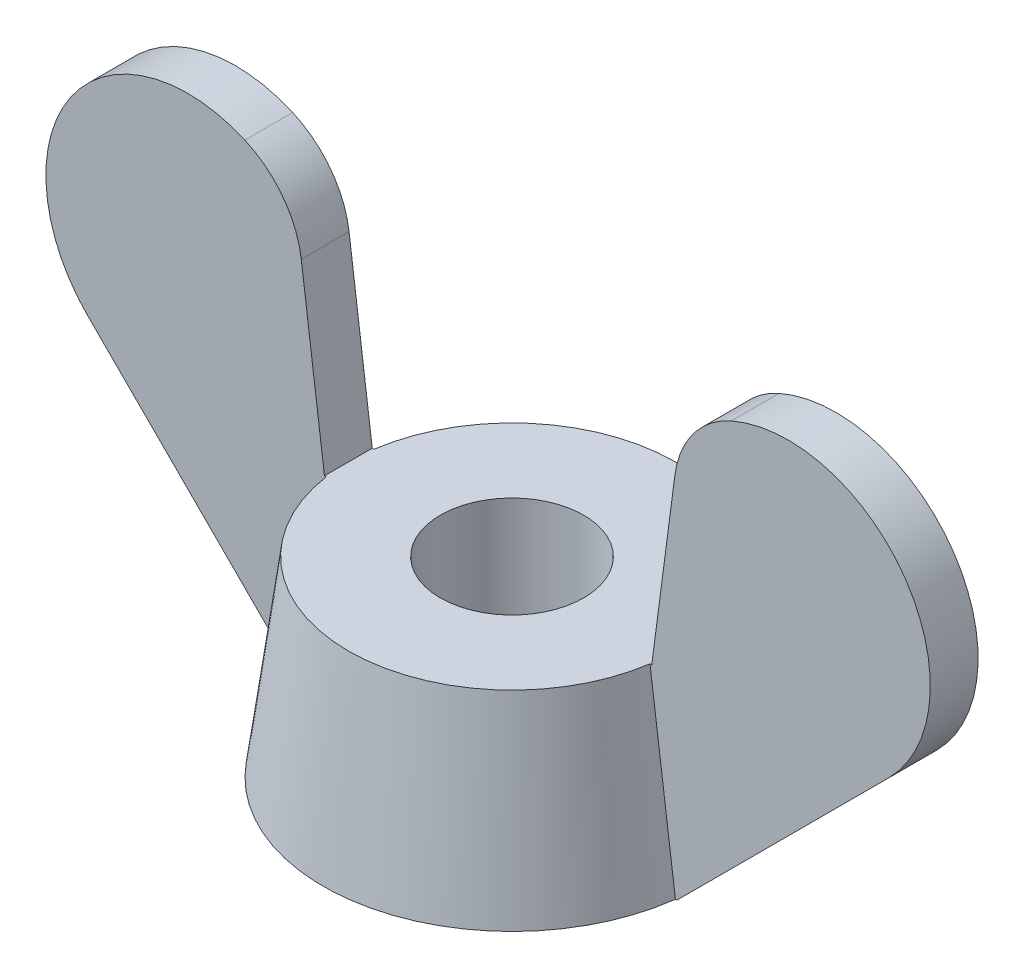
ISO-10303-21;
HEADER;
FILE_DESCRIPTION(('STEP AP214'),'2;1');
FILE_NAME('part.step','',(''),(''),'','','');
FILE_SCHEMA(('AUTOMOTIVE_DESIGN { 1 0 10303 214 1 1 1 1 }'));
ENDSEC;
DATA;
#1=APPLICATION_CONTEXT('core data for automotive mechanical design processes');
#2=APPLICATION_PROTOCOL_DEFINITION('international standard','automotive_design',2000,#1);
#3=PRODUCT_CONTEXT('',#1,'mechanical');
#4=PRODUCT('Part','Part','',(#3));
#5=PRODUCT_RELATED_PRODUCT_CATEGORY('part','',(#4));
#6=PRODUCT_DEFINITION_FORMATION('','',#4);
#7=PRODUCT_DEFINITION_CONTEXT('part definition',#1,'design');
#8=PRODUCT_DEFINITION('design','',#6,#7);
#9=PRODUCT_DEFINITION_SHAPE('','',#8);
#10=(LENGTH_UNIT() NAMED_UNIT(*) SI_UNIT(.MILLI.,.METRE.));
#11=(NAMED_UNIT(*) PLANE_ANGLE_UNIT() SI_UNIT($,.RADIAN.));
#12=(NAMED_UNIT(*) SI_UNIT($,.STERADIAN.) SOLID_ANGLE_UNIT());
#13=UNCERTAINTY_MEASURE_WITH_UNIT(LENGTH_MEASURE(1.E-05),#10,'distance_accuracy_value','');
#14=(GEOMETRIC_REPRESENTATION_CONTEXT(3) GLOBAL_UNCERTAINTY_ASSIGNED_CONTEXT((#13)) GLOBAL_UNIT_ASSIGNED_CONTEXT((#10,
#11,#12)) REPRESENTATION_CONTEXT('',''));
#15=CARTESIAN_POINT('',(0.,0.,0.));
#16=DIRECTION('',(0.,0.,1.));
#17=DIRECTION('',(1.,0.,0.));
#18=AXIS2_PLACEMENT_3D('',#15,#16,#17);
#19=CARTESIAN_POINT('',(0.,0.,0.));
#20=DIRECTION('',(0.,-1.,0.));
#21=DIRECTION('',(0.,0.,1.));
#22=AXIS2_PLACEMENT_3D('',#19,#20,#21);
#23=CONICAL_SURFACE('',#22,3.95,0.130899693899575);
#24=CARTESIAN_POINT('',(-2.79014935307168,8.47233595499958,-0.5));
#25=CARTESIAN_POINT('',(-2.90094093792132,7.64393694550985,-0.5));
#26=CARTESIAN_POINT('',(-3.01154454406097,6.81551283083668,-0.5));
#27=CARTESIAN_POINT('',(-3.23246038122402,5.1586258135231,-0.5));
#28=CARTESIAN_POINT('',(-3.34277261227046,4.33016291088576,-0.5));
#29=CARTESIAN_POINT('',(-3.62976592758949,2.17273839388854,-0.5));
#30=CARTESIAN_POINT('',(-3.80628437354511,0.843755152208538,-0.5));
#31=CARTESIAN_POINT('',(-4.15895766998451,-1.81425975195012,-0.5));
#32=CARTESIAN_POINT('',(-4.33511252042257,-3.14329141443485,-0.5));
#33=CARTESIAN_POINT('',(-4.51116977917809,-4.47233595499958,-0.5));
#34=B_SPLINE_CURVE_WITH_KNOTS('',3,(#24,#25,#26,#27,#28,#29,#30,#31,#32,#33),.UNSPECIFIED.,.F.,
.F.,(4,2,2,2,4),(0.,2.50732464755372,5.01464909685827,9.03661335227564,13.0585781134314),.UNSPECIFIED.);
#35=CARTESIAN_POINT('',(-3.38667966571601,4.,-0.5));
#36=VERTEX_POINT('',#35);
#37=CARTESIAN_POINT('',(-3.91822663969301,0.,-0.5));
#38=VERTEX_POINT('',#37);
#39=EDGE_CURVE('E57',#36,#38,#34,.T.);
#40=ORIENTED_EDGE('',*,*,#39,.F.);
#41=CARTESIAN_POINT('',(0.,4.,0.));
#42=DIRECTION('',(0.,1.,0.));
#43=DIRECTION('',(0.,0.,1.));
#44=AXIS2_PLACEMENT_3D('',#41,#42,#43);
#45=CIRCLE('',#44,3.42339000965042);
#46=CARTESIAN_POINT('',(3.38667966571601,4.,-0.5));
#47=VERTEX_POINT('',#46);
#48=EDGE_CURVE('E11',#47,#36,#45,.T.);
#49=ORIENTED_EDGE('',*,*,#48,.F.);
#50=CARTESIAN_POINT('',(2.79014935307168,8.47233595499958,-0.5));
#51=CARTESIAN_POINT('',(2.90094093792132,7.64393694550985,-0.5));
#52=CARTESIAN_POINT('',(3.01154454406097,6.81551283083668,-0.5));
#53=CARTESIAN_POINT('',(3.23246038122402,5.1586258135231,-0.5));
#54=CARTESIAN_POINT('',(3.34277261227046,4.33016291088576,-0.5));
#55=CARTESIAN_POINT('',(3.62976592758949,2.17273839388854,-0.5));
#56=CARTESIAN_POINT('',(3.80628437354511,0.843755152208538,-0.5));
#57=CARTESIAN_POINT('',(4.15895766998451,-1.81425975195012,-0.5));
#58=CARTESIAN_POINT('',(4.33511252042257,-3.14329141443485,-0.5));
#59=CARTESIAN_POINT('',(4.51116977917809,-4.47233595499958,-0.5));
#60=B_SPLINE_CURVE_WITH_KNOTS('',3,(#50,#51,#52,#53,#54,#55,#56,#57,#58,#59),.UNSPECIFIED.,.F.,
.F.,(4,2,2,2,4),(0.,2.50732464755372,5.01464909685827,9.03661335227564,13.0585781134314),.UNSPECIFIED.);
#61=CARTESIAN_POINT('',(3.91822663969301,0.,-0.5));
#62=VERTEX_POINT('',#61);
#63=EDGE_CURVE('E215',#47,#62,#60,.T.);
#64=ORIENTED_EDGE('',*,*,#63,.T.);
#65=CARTESIAN_POINT('',(0.,0.,0.));
#66=DIRECTION('',(0.,1.,0.));
#67=DIRECTION('',(0.,0.,1.));
#68=AXIS2_PLACEMENT_3D('',#65,#66,#67);
#69=CIRCLE('',#68,3.95);
#70=EDGE_CURVE('E226',#62,#38,#69,.T.);
#71=ORIENTED_EDGE('',*,*,#70,.T.);
#72=EDGE_LOOP('',(#40,#49,#64,#71));
#73=FACE_BOUND('',#72,.T.);
#74=ADVANCED_FACE('F34',(#73),#23,.T.);
#75=CARTESIAN_POINT('',(-3.38667966571601,4.,0.5));
#76=VERTEX_POINT('',#75);
#77=CARTESIAN_POINT('',(3.38667966571601,4.,0.5));
#78=VERTEX_POINT('',#77);
#79=EDGE_CURVE('E43',#76,#78,#45,.T.);
#80=ORIENTED_EDGE('',*,*,#79,.F.);
#81=CARTESIAN_POINT('',(-2.79014935307168,8.47233595499958,0.5));
#82=CARTESIAN_POINT('',(-2.90094093792132,7.64393694550985,0.5));
#83=CARTESIAN_POINT('',(-3.01154454406097,6.81551283083668,0.5));
#84=CARTESIAN_POINT('',(-3.23246038122402,5.1586258135231,0.5));
#85=CARTESIAN_POINT('',(-3.34277261227046,4.33016291088576,0.5));
#86=CARTESIAN_POINT('',(-3.62976592758949,2.17273839388854,0.5));
#87=CARTESIAN_POINT('',(-3.80628437354511,0.843755152208538,0.5));
#88=CARTESIAN_POINT('',(-4.15895766998451,-1.81425975195012,0.5));
#89=CARTESIAN_POINT('',(-4.33511252042257,-3.14329141443485,0.5));
#90=CARTESIAN_POINT('',(-4.51116977917809,-4.47233595499958,0.5));
#91=B_SPLINE_CURVE_WITH_KNOTS('',3,(#81,#82,#83,#84,#85,#86,#87,#88,#89,#90),.UNSPECIFIED.,.F.,
.F.,(4,2,2,2,4),(0.,2.50732464755372,5.01464909685827,9.03661335227564,13.0585781134314),.UNSPECIFIED.);
#92=CARTESIAN_POINT('',(-3.91822663969301,0.,0.5));
#93=VERTEX_POINT('',#92);
#94=EDGE_CURVE('E140',#76,#93,#91,.T.);
#95=ORIENTED_EDGE('',*,*,#94,.T.);
#96=CARTESIAN_POINT('',(3.91822663969301,0.,0.5));
#97=VERTEX_POINT('',#96);
#98=EDGE_CURVE('E224',#93,#97,#69,.T.);
#99=ORIENTED_EDGE('',*,*,#98,.T.);
#100=CARTESIAN_POINT('',(2.79014935307168,8.47233595499958,0.5));
#101=CARTESIAN_POINT('',(2.90094093792132,7.64393694550985,0.5));
#102=CARTESIAN_POINT('',(3.01154454406097,6.81551283083668,0.5));
#103=CARTESIAN_POINT('',(3.23246038122402,5.1586258135231,0.5));
#104=CARTESIAN_POINT('',(3.34277261227046,4.33016291088576,0.5));
#105=CARTESIAN_POINT('',(3.62976592758949,2.17273839388854,0.5));
#106=CARTESIAN_POINT('',(3.80628437354511,0.843755152208538,0.5));
#107=CARTESIAN_POINT('',(4.15895766998451,-1.81425975195012,0.5));
#108=CARTESIAN_POINT('',(4.33511252042257,-3.14329141443485,0.5));
#109=CARTESIAN_POINT('',(4.51116977917809,-4.47233595499958,0.5));
#110=B_SPLINE_CURVE_WITH_KNOTS('',3,(#100,#101,#102,#103,#104,#105,#106,#107,#108,#109),
.UNSPECIFIED.,.F.,.F.,(4,2,2,2,4),(0.,2.50732464755372,5.01464909685827,9.03661335227564,
13.0585781134314),.UNSPECIFIED.);
#111=EDGE_CURVE('E206',#78,#97,#110,.T.);
#112=ORIENTED_EDGE('',*,*,#111,.F.);
#113=EDGE_LOOP('',(#80,#95,#99,#112));
#114=FACE_BOUND('',#113,.T.);
#115=ADVANCED_FACE('F36',(#114),#23,.T.);
#116=CARTESIAN_POINT('',(0.,4.,0.));
#117=DIRECTION('',(0.,1.,0.));
#118=DIRECTION('',(0.,0.,1.));
#119=AXIS2_PLACEMENT_3D('',#116,#117,#118);
#120=PLANE('',#119);
#121=DIRECTION('',(-1.,0.,0.));
#122=VECTOR('',#121,1.);
#123=CARTESIAN_POINT('',(-3.42339000965042,4.,-0.5));
#124=LINE('',#123,#122);
#125=CARTESIAN_POINT('',(-3.42339000965042,4.,-0.5));
#126=VERTEX_POINT('',#125);
#127=EDGE_CURVE('E157',#36,#126,#124,.T.);
#128=ORIENTED_EDGE('',*,*,#127,.T.);
#129=DIRECTION('',(0.,0.,-1.));
#130=VECTOR('',#129,1.);
#131=CARTESIAN_POINT('',(-3.42339000965042,4.,0.5));
#132=LINE('',#131,#130);
#133=CARTESIAN_POINT('',(-3.42339000965042,4.,0.5));
#134=VERTEX_POINT('',#133);
#135=EDGE_CURVE('E147',#134,#126,#132,.T.);
#136=ORIENTED_EDGE('',*,*,#135,.F.);
#137=DIRECTION('',(-1.,0.,0.));
#138=VECTOR('',#137,1.);
#139=CARTESIAN_POINT('',(-3.42339000965042,4.,0.5));
#140=LINE('',#139,#138);
#141=EDGE_CURVE('E134',#76,#134,#140,.T.);
#142=ORIENTED_EDGE('',*,*,#141,.F.);
#143=ORIENTED_EDGE('',*,*,#79,.T.);
#144=DIRECTION('',(-1.,0.,0.));
#145=VECTOR('',#144,1.);
#146=CARTESIAN_POINT('',(3.42339000965042,4.,0.5));
#147=LINE('',#146,#145);
#148=CARTESIAN_POINT('',(3.42339000965042,4.,0.5));
#149=VERTEX_POINT('',#148);
#150=EDGE_CURVE('E238',#149,#78,#147,.T.);
#151=ORIENTED_EDGE('',*,*,#150,.F.);
#152=DIRECTION('',(0.,0.,-1.));
#153=VECTOR('',#152,1.);
#154=CARTESIAN_POINT('',(3.42339000965042,4.,0.5));
#155=LINE('',#154,#153);
#156=CARTESIAN_POINT('',(3.42339000965042,4.,-0.5));
#157=VERTEX_POINT('',#156);
#158=EDGE_CURVE('E258',#149,#157,#155,.T.);
#159=ORIENTED_EDGE('',*,*,#158,.T.);
#160=DIRECTION('',(-1.,0.,0.));
#161=VECTOR('',#160,1.);
#162=CARTESIAN_POINT('',(3.42339000965042,4.,-0.5));
#163=LINE('',#162,#161);
#164=EDGE_CURVE('E245',#157,#47,#163,.T.);
#165=ORIENTED_EDGE('',*,*,#164,.T.);
#166=ORIENTED_EDGE('',*,*,#48,.T.);
#167=EDGE_LOOP('',(#128,#136,#142,#143,#151,#159,#165,#166));
#168=FACE_BOUND('',#167,.T.);
#169=CARTESIAN_POINT('',(0.,4.,0.));
#170=DIRECTION('',(0.,1.,0.));
#171=DIRECTION('',(0.,0.,1.));
#172=AXIS2_PLACEMENT_3D('',#169,#170,#171);
#173=CIRCLE('',#172,1.5);
#174=CARTESIAN_POINT('',(0.,4.,1.5));
#175=VERTEX_POINT('',#174);
#176=EDGE_CURVE('E221',#175,#175,#173,.T.);
#177=ORIENTED_EDGE('',*,*,#176,.F.);
#178=EDGE_LOOP('',(#177));
#179=FACE_BOUND('',#178,.T.);
#180=ADVANCED_FACE('F154',(#168,#179),#120,.T.);
#181=CARTESIAN_POINT('',(0.,0.,0.));
#182=DIRECTION('',(0.,1.,0.));
#183=DIRECTION('',(0.,0.,1.));
#184=AXIS2_PLACEMENT_3D('',#181,#182,#183);
#185=PLANE('',#184);
#186=ORIENTED_EDGE('',*,*,#98,.F.);
#187=DIRECTION('',(1.,0.,0.));
#188=VECTOR('',#187,1.);
#189=CARTESIAN_POINT('',(-1.95,0.,0.5));
#190=LINE('',#189,#188);
#191=CARTESIAN_POINT('',(-3.95,0.,0.5));
#192=VERTEX_POINT('',#191);
#193=EDGE_CURVE('E296',#192,#93,#190,.T.);
#194=ORIENTED_EDGE('',*,*,#193,.F.);
#195=DIRECTION('',(0.,0.,-1.));
#196=VECTOR('',#195,1.);
#197=CARTESIAN_POINT('',(-3.95,0.,0.5));
#198=LINE('',#197,#196);
#199=CARTESIAN_POINT('',(-3.95,0.,-0.5));
#200=VERTEX_POINT('',#199);
#201=EDGE_CURVE('E285',#192,#200,#198,.T.);
#202=ORIENTED_EDGE('',*,*,#201,.T.);
#203=DIRECTION('',(1.,0.,0.));
#204=VECTOR('',#203,1.);
#205=CARTESIAN_POINT('',(-1.95,0.,-0.5));
#206=LINE('',#205,#204);
#207=EDGE_CURVE('E143',#200,#38,#206,.T.);
#208=ORIENTED_EDGE('',*,*,#207,.T.);
#209=ORIENTED_EDGE('',*,*,#70,.F.);
#210=DIRECTION('',(1.,0.,0.));
#211=VECTOR('',#210,1.);
#212=CARTESIAN_POINT('',(1.95,0.,-0.5));
#213=LINE('',#212,#211);
#214=CARTESIAN_POINT('',(3.95,0.,-0.5));
#215=VERTEX_POINT('',#214);
#216=EDGE_CURVE('E259',#62,#215,#213,.T.);
#217=ORIENTED_EDGE('',*,*,#216,.T.);
#218=DIRECTION('',(0.,0.,-1.));
#219=VECTOR('',#218,1.);
#220=CARTESIAN_POINT('',(3.95,0.,0.5));
#221=LINE('',#220,#219);
#222=CARTESIAN_POINT('',(3.95,0.,0.5));
#223=VERTEX_POINT('',#222);
#224=EDGE_CURVE('E243',#223,#215,#221,.T.);
#225=ORIENTED_EDGE('',*,*,#224,.F.);
#226=DIRECTION('',(1.,0.,0.));
#227=VECTOR('',#226,1.);
#228=CARTESIAN_POINT('',(1.95,0.,0.5));
#229=LINE('',#228,#227);
#230=EDGE_CURVE('E234',#97,#223,#229,.T.);
#231=ORIENTED_EDGE('',*,*,#230,.F.);
#232=EDGE_LOOP('',(#186,#194,#202,#208,#209,#217,#225,#231));
#233=FACE_BOUND('',#232,.T.);
#234=CARTESIAN_POINT('',(0.,0.,0.));
#235=DIRECTION('',(0.,1.,0.));
#236=DIRECTION('',(0.,0.,1.));
#237=AXIS2_PLACEMENT_3D('',#234,#235,#236);
#238=CIRCLE('',#237,1.5);
#239=CARTESIAN_POINT('',(0.,0.,1.5));
#240=VERTEX_POINT('',#239);
#241=EDGE_CURVE('E214',#240,#240,#238,.T.);
#242=ORIENTED_EDGE('',*,*,#241,.T.);
#243=EDGE_LOOP('',(#242));
#244=FACE_BOUND('',#243,.T.);
#245=ADVANCED_FACE('F240',(#233,#244),#185,.F.);
#246=CARTESIAN_POINT('',(0.,4.,0.));
#247=DIRECTION('',(0.,-1.,0.));
#248=DIRECTION('',(0.,0.,-1.));
#249=AXIS2_PLACEMENT_3D('',#246,#247,#248);
#250=CYLINDRICAL_SURFACE('',#249,1.5);
#251=ORIENTED_EDGE('',*,*,#176,.T.);
#252=EDGE_LOOP('',(#251));
#253=FACE_BOUND('',#252,.T.);
#254=ORIENTED_EDGE('',*,*,#241,.F.);
#255=EDGE_LOOP('',(#254));
#256=FACE_BOUND('',#255,.T.);
#257=ADVANCED_FACE('F201',(#253,#256),#250,.F.);
#258=CARTESIAN_POINT('',(6.28015151901647,6.53015151901647,0.5));
#259=DIRECTION('',(0.,0.,-1.));
#260=DIRECTION('',(-1.,0.,0.));
#261=AXIS2_PLACEMENT_3D('',#258,#259,#260);
#262=PLANE('',#261);
#263=ORIENTED_EDGE('',*,*,#150,.T.);
#264=ORIENTED_EDGE('',*,*,#111,.T.);
#265=ORIENTED_EDGE('',*,*,#230,.T.);
#266=DIRECTION('',(0.707106781186551,0.707106781186544,0.));
#267=VECTOR('',#266,1.);
#268=CARTESIAN_POINT('',(8.38015151901648,4.43015151901643,0.5));
#269=LINE('',#268,#267);
#270=CARTESIAN_POINT('',(8.38015151901648,4.43015151901643,0.5));
#271=VERTEX_POINT('',#270);
#272=EDGE_CURVE('E244',#223,#271,#269,.T.);
#273=ORIENTED_EDGE('',*,*,#272,.T.);
#274=CARTESIAN_POINT('',(6.28015151901647,6.53015151901647,0.5));
#275=DIRECTION('',(0.,0.,1.));
#276=DIRECTION('',(-1.,0.,0.));
#277=AXIS2_PLACEMENT_3D('',#274,#275,#276);
#278=CIRCLE('',#277,2.96984848098353);
#279=CARTESIAN_POINT('',(5.08753295236047,9.25001566166543,0.5));
#280=VERTEX_POINT('',#279);
#281=EDGE_CURVE('E246',#271,#280,#278,.T.);
#282=ORIENTED_EDGE('',*,*,#281,.T.);
#283=CARTESIAN_POINT('',(5.89068407221897,7.41836387197668,0.5));
#284=DIRECTION('',(0.,0.,1.));
#285=DIRECTION('',(-1.,0.,0.));
#286=AXIS2_PLACEMENT_3D('',#283,#284,#285);
#287=CIRCLE('',#286,2.);
#288=CARTESIAN_POINT('',(3.90779434947135,7.67941625641678,0.5));
#289=VERTEX_POINT('',#288);
#290=EDGE_CURVE('E253',#280,#289,#287,.T.);
#291=ORIENTED_EDGE('',*,*,#290,.T.);
#292=DIRECTION('',(-0.130526192220052,-0.99144486137381,0.));
#293=VECTOR('',#292,1.);
#294=CARTESIAN_POINT('',(3.90779434947135,7.67941625641678,0.5));
#295=LINE('',#294,#293);
#296=EDGE_CURVE('E255',#289,#149,#295,.T.);
#297=ORIENTED_EDGE('',*,*,#296,.T.);
#298=EDGE_LOOP('',(#263,#264,#265,#273,#282,#291,#297));
#299=FACE_BOUND('',#298,.T.);
#300=ADVANCED_FACE('F196',(#299),#262,.F.);
#301=CARTESIAN_POINT('',(6.28015151901647,6.53015151901647,-0.5));
#302=DIRECTION('',(0.,0.,-1.));
#303=DIRECTION('',(-1.,0.,0.));
#304=AXIS2_PLACEMENT_3D('',#301,#302,#303);
#305=PLANE('',#304);
#306=ORIENTED_EDGE('',*,*,#63,.F.);
#307=ORIENTED_EDGE('',*,*,#164,.F.);
#308=DIRECTION('',(-0.130526192220052,-0.99144486137381,0.));
#309=VECTOR('',#308,1.);
#310=CARTESIAN_POINT('',(3.90779434947135,7.67941625641678,-0.5));
#311=LINE('',#310,#309);
#312=CARTESIAN_POINT('',(3.90779434947135,7.67941625641678,-0.5));
#313=VERTEX_POINT('',#312);
#314=EDGE_CURVE('E249',#313,#157,#311,.T.);
#315=ORIENTED_EDGE('',*,*,#314,.F.);
#316=CARTESIAN_POINT('',(5.89068407221897,7.41836387197668,-0.5));
#317=DIRECTION('',(0.,0.,1.));
#318=DIRECTION('',(-1.,0.,0.));
#319=AXIS2_PLACEMENT_3D('',#316,#317,#318);
#320=CIRCLE('',#319,2.);
#321=CARTESIAN_POINT('',(5.08753295236047,9.25001566166543,-0.5));
#322=VERTEX_POINT('',#321);
#323=EDGE_CURVE('E265',#322,#313,#320,.T.);
#324=ORIENTED_EDGE('',*,*,#323,.F.);
#325=CARTESIAN_POINT('',(6.28015151901647,6.53015151901647,-0.5));
#326=DIRECTION('',(0.,0.,1.));
#327=DIRECTION('',(-1.,0.,0.));
#328=AXIS2_PLACEMENT_3D('',#325,#326,#327);
#329=CIRCLE('',#328,2.96984848098353);
#330=CARTESIAN_POINT('',(8.38015151901648,4.43015151901643,-0.5));
#331=VERTEX_POINT('',#330);
#332=EDGE_CURVE('E263',#331,#322,#329,.T.);
#333=ORIENTED_EDGE('',*,*,#332,.F.);
#334=DIRECTION('',(0.707106781186551,0.707106781186544,0.));
#335=VECTOR('',#334,1.);
#336=CARTESIAN_POINT('',(8.38015151901648,4.43015151901643,-0.5));
#337=LINE('',#336,#335);
#338=EDGE_CURVE('E261',#215,#331,#337,.T.);
#339=ORIENTED_EDGE('',*,*,#338,.F.);
#340=ORIENTED_EDGE('',*,*,#216,.F.);
#341=EDGE_LOOP('',(#306,#307,#315,#324,#333,#339,#340));
#342=FACE_BOUND('',#341,.T.);
#343=ADVANCED_FACE('F200',(#342),#305,.T.);
#344=CARTESIAN_POINT('',(8.38015151901648,4.43015151901643,0.5));
#345=DIRECTION('',(-0.707106781186544,0.707106781186551,0.));
#346=DIRECTION('',(-0.707106781186551,-0.707106781186544,0.));
#347=AXIS2_PLACEMENT_3D('',#344,#345,#346);
#348=PLANE('',#347);
#349=ORIENTED_EDGE('',*,*,#338,.T.);
#350=DIRECTION('',(0.,0.,-1.));
#351=VECTOR('',#350,1.);
#352=CARTESIAN_POINT('',(8.38015151901648,4.43015151901643,0.5));
#353=LINE('',#352,#351);
#354=EDGE_CURVE('E276',#271,#331,#353,.T.);
#355=ORIENTED_EDGE('',*,*,#354,.F.);
#356=ORIENTED_EDGE('',*,*,#272,.F.);
#357=ORIENTED_EDGE('',*,*,#224,.T.);
#358=EDGE_LOOP('',(#349,#355,#356,#357));
#359=FACE_BOUND('',#358,.T.);
#360=ADVANCED_FACE('F319',(#359),#348,.F.);
#361=CARTESIAN_POINT('',(6.28015151901647,6.53015151901647,0.5));
#362=DIRECTION('',(0.,0.,-1.));
#363=DIRECTION('',(-1.,0.,0.));
#364=AXIS2_PLACEMENT_3D('',#361,#362,#363);
#365=CYLINDRICAL_SURFACE('',#364,2.96984848098353);
#366=ORIENTED_EDGE('',*,*,#332,.T.);
#367=DIRECTION('',(0.,0.,-1.));
#368=VECTOR('',#367,1.);
#369=CARTESIAN_POINT('',(5.08753295236047,9.25001566166543,0.5));
#370=LINE('',#369,#368);
#371=EDGE_CURVE('E273',#280,#322,#370,.T.);
#372=ORIENTED_EDGE('',*,*,#371,.F.);
#373=ORIENTED_EDGE('',*,*,#281,.F.);
#374=ORIENTED_EDGE('',*,*,#354,.T.);
#375=EDGE_LOOP('',(#366,#372,#373,#374));
#376=FACE_BOUND('',#375,.T.);
#377=ADVANCED_FACE('F322',(#376),#365,.T.);
#378=CARTESIAN_POINT('',(5.89068407221897,7.41836387197668,0.5));
#379=DIRECTION('',(0.,0.,-1.));
#380=DIRECTION('',(-1.,0.,0.));
#381=AXIS2_PLACEMENT_3D('',#378,#379,#380);
#382=CYLINDRICAL_SURFACE('',#381,2.);
#383=ORIENTED_EDGE('',*,*,#323,.T.);
#384=DIRECTION('',(0.,0.,-1.));
#385=VECTOR('',#384,1.);
#386=CARTESIAN_POINT('',(3.90779434947135,7.67941625641678,0.5));
#387=LINE('',#386,#385);
#388=EDGE_CURVE('E270',#289,#313,#387,.T.);
#389=ORIENTED_EDGE('',*,*,#388,.F.);
#390=ORIENTED_EDGE('',*,*,#290,.F.);
#391=ORIENTED_EDGE('',*,*,#371,.T.);
#392=EDGE_LOOP('',(#383,#389,#390,#391));
#393=FACE_BOUND('',#392,.T.);
#394=ADVANCED_FACE('F328',(#393),#382,.T.);
#395=CARTESIAN_POINT('',(3.90779434947135,7.67941625641678,0.5));
#396=DIRECTION('',(0.99144486137381,-0.130526192220052,0.));
#397=DIRECTION('',(0.130526192220052,0.99144486137381,0.));
#398=AXIS2_PLACEMENT_3D('',#395,#396,#397);
#399=PLANE('',#398);
#400=ORIENTED_EDGE('',*,*,#314,.T.);
#401=ORIENTED_EDGE('',*,*,#158,.F.);
#402=ORIENTED_EDGE('',*,*,#296,.F.);
#403=ORIENTED_EDGE('',*,*,#388,.T.);
#404=EDGE_LOOP('',(#400,#401,#402,#403));
#405=FACE_BOUND('',#404,.T.);
#406=ADVANCED_FACE('F331',(#405),#399,.F.);
#407=CARTESIAN_POINT('',(-6.28015151901647,6.53015151901647,0.5));
#408=DIRECTION('',(0.,0.,1.));
#409=DIRECTION('',(1.,0.,0.));
#410=AXIS2_PLACEMENT_3D('',#407,#408,#409);
#411=PLANE('',#410);
#412=ORIENTED_EDGE('',*,*,#94,.F.);
#413=ORIENTED_EDGE('',*,*,#141,.T.);
#414=DIRECTION('',(-0.130526192220052,0.99144486137381,0.));
#415=VECTOR('',#414,1.);
#416=CARTESIAN_POINT('',(-3.90779434947135,7.67941625641678,0.5));
#417=LINE('',#416,#415);
#418=CARTESIAN_POINT('',(-3.90779434947135,7.67941625641678,0.5));
#419=VERTEX_POINT('',#418);
#420=EDGE_CURVE('E137',#134,#419,#417,.T.);
#421=ORIENTED_EDGE('',*,*,#420,.T.);
#422=CARTESIAN_POINT('',(-5.89068407221897,7.41836387197668,0.5));
#423=DIRECTION('',(0.,0.,1.));
#424=DIRECTION('',(1.,0.,0.));
#425=AXIS2_PLACEMENT_3D('',#422,#423,#424);
#426=CIRCLE('',#425,2.);
#427=CARTESIAN_POINT('',(-5.08753295236047,9.25001566166543,0.5));
#428=VERTEX_POINT('',#427);
#429=EDGE_CURVE('E152',#419,#428,#426,.T.);
#430=ORIENTED_EDGE('',*,*,#429,.T.);
#431=CARTESIAN_POINT('',(-6.28015151901647,6.53015151901647,0.5));
#432=DIRECTION('',(0.,0.,1.));
#433=DIRECTION('',(1.,0.,0.));
#434=AXIS2_PLACEMENT_3D('',#431,#432,#433);
#435=CIRCLE('',#434,2.96984848098353);
#436=CARTESIAN_POINT('',(-8.38015151901648,4.43015151901643,0.5));
#437=VERTEX_POINT('',#436);
#438=EDGE_CURVE('E303',#428,#437,#435,.T.);
#439=ORIENTED_EDGE('',*,*,#438,.T.);
#440=DIRECTION('',(0.707106781186551,-0.707106781186544,0.));
#441=VECTOR('',#440,1.);
#442=CARTESIAN_POINT('',(-8.38015151901648,4.43015151901643,0.5));
#443=LINE('',#442,#441);
#444=EDGE_CURVE('E312',#437,#192,#443,.T.);
#445=ORIENTED_EDGE('',*,*,#444,.T.);
#446=ORIENTED_EDGE('',*,*,#193,.T.);
#447=EDGE_LOOP('',(#412,#413,#421,#430,#439,#445,#446));
#448=FACE_BOUND('',#447,.T.);
#449=ADVANCED_FACE('F136',(#448),#411,.T.);
#450=CARTESIAN_POINT('',(-6.28015151901647,6.53015151901647,-0.5));
#451=DIRECTION('',(0.,0.,1.));
#452=DIRECTION('',(1.,0.,0.));
#453=AXIS2_PLACEMENT_3D('',#450,#451,#452);
#454=PLANE('',#453);
#455=ORIENTED_EDGE('',*,*,#127,.F.);
#456=ORIENTED_EDGE('',*,*,#39,.T.);
#457=ORIENTED_EDGE('',*,*,#207,.F.);
#458=DIRECTION('',(0.707106781186551,-0.707106781186544,0.));
#459=VECTOR('',#458,1.);
#460=CARTESIAN_POINT('',(-8.38015151901648,4.43015151901643,-0.5));
#461=LINE('',#460,#459);
#462=CARTESIAN_POINT('',(-8.38015151901648,4.43015151901643,-0.5));
#463=VERTEX_POINT('',#462);
#464=EDGE_CURVE('E288',#463,#200,#461,.T.);
#465=ORIENTED_EDGE('',*,*,#464,.F.);
#466=CARTESIAN_POINT('',(-6.28015151901647,6.53015151901647,-0.5));
#467=DIRECTION('',(0.,0.,1.));
#468=DIRECTION('',(1.,0.,0.));
#469=AXIS2_PLACEMENT_3D('',#466,#467,#468);
#470=CIRCLE('',#469,2.96984848098353);
#471=CARTESIAN_POINT('',(-5.08753295236047,9.25001566166543,-0.5));
#472=VERTEX_POINT('',#471);
#473=EDGE_CURVE('E290',#472,#463,#470,.T.);
#474=ORIENTED_EDGE('',*,*,#473,.F.);
#475=CARTESIAN_POINT('',(-5.89068407221897,7.41836387197668,-0.5));
#476=DIRECTION('',(0.,0.,1.));
#477=DIRECTION('',(1.,0.,0.));
#478=AXIS2_PLACEMENT_3D('',#475,#476,#477);
#479=CIRCLE('',#478,2.);
#480=CARTESIAN_POINT('',(-3.90779434947135,7.67941625641678,-0.5));
#481=VERTEX_POINT('',#480);
#482=EDGE_CURVE('E305',#481,#472,#479,.T.);
#483=ORIENTED_EDGE('',*,*,#482,.F.);
#484=DIRECTION('',(-0.130526192220052,0.99144486137381,0.));
#485=VECTOR('',#484,1.);
#486=CARTESIAN_POINT('',(-3.90779434947135,7.67941625641678,-0.5));
#487=LINE('',#486,#485);
#488=EDGE_CURVE('E306',#126,#481,#487,.T.);
#489=ORIENTED_EDGE('',*,*,#488,.F.);
#490=EDGE_LOOP('',(#455,#456,#457,#465,#474,#483,#489));
#491=FACE_BOUND('',#490,.T.);
#492=ADVANCED_FACE('F176',(#491),#454,.F.);
#493=CARTESIAN_POINT('',(-3.90779434947135,7.67941625641678,0.5));
#494=DIRECTION('',(-0.99144486137381,-0.130526192220052,0.));
#495=DIRECTION('',(0.130526192220052,-0.99144486137381,0.));
#496=AXIS2_PLACEMENT_3D('',#493,#494,#495);
#497=PLANE('',#496);
#498=ORIENTED_EDGE('',*,*,#488,.T.);
#499=DIRECTION('',(0.,0.,-1.));
#500=VECTOR('',#499,1.);
#501=CARTESIAN_POINT('',(-3.90779434947135,7.67941625641678,0.5));
#502=LINE('',#501,#500);
#503=EDGE_CURVE('E150',#419,#481,#502,.T.);
#504=ORIENTED_EDGE('',*,*,#503,.F.);
#505=ORIENTED_EDGE('',*,*,#420,.F.);
#506=ORIENTED_EDGE('',*,*,#135,.T.);
#507=EDGE_LOOP('',(#498,#504,#505,#506));
#508=FACE_BOUND('',#507,.T.);
#509=ADVANCED_FACE('F146',(#508),#497,.F.);
#510=CARTESIAN_POINT('',(-5.89068407221897,7.41836387197668,0.5));
#511=DIRECTION('',(0.,0.,-1.));
#512=DIRECTION('',(-1.,0.,0.));
#513=AXIS2_PLACEMENT_3D('',#510,#511,#512);
#514=CYLINDRICAL_SURFACE('',#513,2.);
#515=ORIENTED_EDGE('',*,*,#482,.T.);
#516=DIRECTION('',(0.,0.,-1.));
#517=VECTOR('',#516,1.);
#518=CARTESIAN_POINT('',(-5.08753295236047,9.25001566166543,0.5));
#519=LINE('',#518,#517);
#520=EDGE_CURVE('E161',#428,#472,#519,.T.);
#521=ORIENTED_EDGE('',*,*,#520,.F.);
#522=ORIENTED_EDGE('',*,*,#429,.F.);
#523=ORIENTED_EDGE('',*,*,#503,.T.);
#524=EDGE_LOOP('',(#515,#521,#522,#523));
#525=FACE_BOUND('',#524,.T.);
#526=ADVANCED_FACE('F189',(#525),#514,.T.);
#527=CARTESIAN_POINT('',(-6.28015151901647,6.53015151901647,0.5));
#528=DIRECTION('',(0.,0.,-1.));
#529=DIRECTION('',(-1.,0.,0.));
#530=AXIS2_PLACEMENT_3D('',#527,#528,#529);
#531=CYLINDRICAL_SURFACE('',#530,2.96984848098353);
#532=ORIENTED_EDGE('',*,*,#473,.T.);
#533=DIRECTION('',(0.,0.,-1.));
#534=VECTOR('',#533,1.);
#535=CARTESIAN_POINT('',(-8.38015151901648,4.43015151901643,0.5));
#536=LINE('',#535,#534);
#537=EDGE_CURVE('E295',#437,#463,#536,.T.);
#538=ORIENTED_EDGE('',*,*,#537,.F.);
#539=ORIENTED_EDGE('',*,*,#438,.F.);
#540=ORIENTED_EDGE('',*,*,#520,.T.);
#541=EDGE_LOOP('',(#532,#538,#539,#540));
#542=FACE_BOUND('',#541,.T.);
#543=ADVANCED_FACE('F185',(#542),#531,.T.);
#544=CARTESIAN_POINT('',(-8.38015151901648,4.43015151901643,0.5));
#545=DIRECTION('',(0.707106781186544,0.707106781186551,0.));
#546=DIRECTION('',(-0.707106781186551,0.707106781186544,0.));
#547=AXIS2_PLACEMENT_3D('',#544,#545,#546);
#548=PLANE('',#547);
#549=ORIENTED_EDGE('',*,*,#464,.T.);
#550=ORIENTED_EDGE('',*,*,#201,.F.);
#551=ORIENTED_EDGE('',*,*,#444,.F.);
#552=ORIENTED_EDGE('',*,*,#537,.T.);
#553=EDGE_LOOP('',(#549,#550,#551,#552));
#554=FACE_BOUND('',#553,.T.);
#555=ADVANCED_FACE('F182',(#554),#548,.F.);
#556=CLOSED_SHELL('',(#74,#115,#180,#245,#257,#300,#343,#360,#377,#394,#406,#449,#492,#509,#526,
#543,#555));
#557=MANIFOLD_SOLID_BREP('B2',#556);
#558=ADVANCED_BREP_SHAPE_REPRESENTATION('',(#18,#557),#14);
#559=SHAPE_DEFINITION_REPRESENTATION(#9,#558);
ENDSEC;
END-ISO-10303-21;
